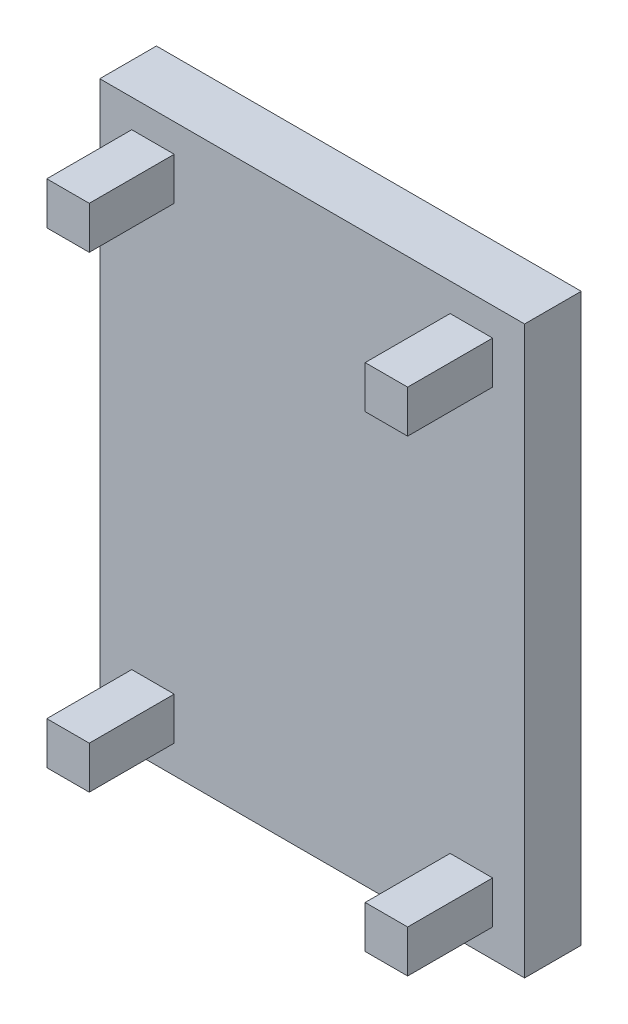
ISO-10303-21;
HEADER;
FILE_DESCRIPTION(('STEP AP214'),'2;1');
FILE_NAME('part.step','',(''),(''),'','','');
FILE_SCHEMA(('AUTOMOTIVE_DESIGN { 1 0 10303 214 1 1 1 1 }'));
ENDSEC;
DATA;
#1=APPLICATION_CONTEXT('core data for automotive mechanical design processes');
#2=APPLICATION_PROTOCOL_DEFINITION('international standard','automotive_design',2000,#1);
#3=PRODUCT_CONTEXT('',#1,'mechanical');
#4=PRODUCT('Part','Part','',(#3));
#5=PRODUCT_RELATED_PRODUCT_CATEGORY('part','',(#4));
#6=PRODUCT_DEFINITION_FORMATION('','',#4);
#7=PRODUCT_DEFINITION_CONTEXT('part definition',#1,'design');
#8=PRODUCT_DEFINITION('design','',#6,#7);
#9=PRODUCT_DEFINITION_SHAPE('','',#8);
#10=(LENGTH_UNIT() NAMED_UNIT(*) SI_UNIT(.MILLI.,.METRE.));
#11=(NAMED_UNIT(*) PLANE_ANGLE_UNIT() SI_UNIT($,.RADIAN.));
#12=(NAMED_UNIT(*) SI_UNIT($,.STERADIAN.) SOLID_ANGLE_UNIT());
#13=UNCERTAINTY_MEASURE_WITH_UNIT(LENGTH_MEASURE(1.E-05),#10,'distance_accuracy_value','');
#14=(GEOMETRIC_REPRESENTATION_CONTEXT(3) GLOBAL_UNCERTAINTY_ASSIGNED_CONTEXT((#13)) GLOBAL_UNIT_ASSIGNED_CONTEXT((#10,
#11,#12)) REPRESENTATION_CONTEXT('',''));
#15=CARTESIAN_POINT('',(0.,0.,0.));
#16=DIRECTION('',(0.,0.,1.));
#17=DIRECTION('',(1.,0.,0.));
#18=AXIS2_PLACEMENT_3D('',#15,#16,#17);
#19=CARTESIAN_POINT('',(0.,0.,200.));
#20=DIRECTION('',(0.,0.,-1.));
#21=DIRECTION('',(-1.,0.,0.));
#22=AXIS2_PLACEMENT_3D('',#19,#20,#21);
#23=PLANE('',#22);
#24=DIRECTION('',(0.,1.,0.));
#25=VECTOR('',#24,1.);
#26=CARTESIAN_POINT('',(637.101095116361,-750.42306476972,200.));
#27=LINE('',#26,#25);
#28=CARTESIAN_POINT('',(637.101095116361,-900.42306476972,200.));
#29=VERTEX_POINT('',#28);
#30=CARTESIAN_POINT('',(637.101095116361,-750.42306476972,200.));
#31=VERTEX_POINT('',#30);
#32=EDGE_CURVE('E227',#29,#31,#27,.T.);
#33=ORIENTED_EDGE('',*,*,#32,.F.);
#34=DIRECTION('',(1.,0.,0.));
#35=VECTOR('',#34,1.);
#36=CARTESIAN_POINT('',(637.101095116361,-900.42306476972,200.));
#37=LINE('',#36,#35);
#38=CARTESIAN_POINT('',(487.101095116362,-900.42306476972,200.));
#39=VERTEX_POINT('',#38);
#40=EDGE_CURVE('E217',#39,#29,#37,.T.);
#41=ORIENTED_EDGE('',*,*,#40,.F.);
#42=DIRECTION('',(0.,-1.,0.));
#43=VECTOR('',#42,1.);
#44=CARTESIAN_POINT('',(487.101095116362,-750.42306476972,200.));
#45=LINE('',#44,#43);
#46=CARTESIAN_POINT('',(487.101095116362,-750.42306476972,200.));
#47=VERTEX_POINT('',#46);
#48=EDGE_CURVE('E220',#47,#39,#45,.T.);
#49=ORIENTED_EDGE('',*,*,#48,.F.);
#50=DIRECTION('',(-1.,0.,0.));
#51=VECTOR('',#50,1.);
#52=CARTESIAN_POINT('',(637.101095116361,-750.42306476972,200.));
#53=LINE('',#52,#51);
#54=EDGE_CURVE('E224',#31,#47,#53,.T.);
#55=ORIENTED_EDGE('',*,*,#54,.F.);
#56=EDGE_LOOP('',(#33,#41,#49,#55));
#57=FACE_BOUND('',#56,.T.);
#58=DIRECTION('',(0.,1.,0.));
#59=VECTOR('',#58,1.);
#60=CARTESIAN_POINT('',(-487.101095116362,750.42306476972,200.));
#61=LINE('',#60,#59);
#62=CARTESIAN_POINT('',(-487.101095116362,750.42306476972,200.));
#63=VERTEX_POINT('',#62);
#64=CARTESIAN_POINT('',(-487.101095116362,900.42306476972,200.));
#65=VERTEX_POINT('',#64);
#66=EDGE_CURVE('E263',#63,#65,#61,.T.);
#67=ORIENTED_EDGE('',*,*,#66,.F.);
#68=DIRECTION('',(1.,0.,0.));
#69=VECTOR('',#68,1.);
#70=CARTESIAN_POINT('',(-637.101095116362,750.42306476972,200.));
#71=LINE('',#70,#69);
#72=CARTESIAN_POINT('',(-637.101095116362,750.42306476972,200.));
#73=VERTEX_POINT('',#72);
#74=EDGE_CURVE('E275',#73,#63,#71,.T.);
#75=ORIENTED_EDGE('',*,*,#74,.F.);
#76=DIRECTION('',(0.,-1.,0.));
#77=VECTOR('',#76,1.);
#78=CARTESIAN_POINT('',(-637.101095116362,750.42306476972,200.));
#79=LINE('',#78,#77);
#80=CARTESIAN_POINT('',(-637.101095116362,900.42306476972,200.));
#81=VERTEX_POINT('',#80);
#82=EDGE_CURVE('E287',#81,#73,#79,.T.);
#83=ORIENTED_EDGE('',*,*,#82,.F.);
#84=DIRECTION('',(-1.,0.,0.));
#85=VECTOR('',#84,1.);
#86=CARTESIAN_POINT('',(-637.101095116362,900.42306476972,200.));
#87=LINE('',#86,#85);
#88=EDGE_CURVE('E284',#65,#81,#87,.T.);
#89=ORIENTED_EDGE('',*,*,#88,.F.);
#90=EDGE_LOOP('',(#67,#75,#83,#89));
#91=FACE_BOUND('',#90,.T.);
#92=DIRECTION('',(0.,1.,0.));
#93=VECTOR('',#92,1.);
#94=CARTESIAN_POINT('',(750.,-1000.,200.));
#95=LINE('',#94,#93);
#96=CARTESIAN_POINT('',(750.,-1000.,200.));
#97=VERTEX_POINT('',#96);
#98=CARTESIAN_POINT('',(750.,1000.,200.));
#99=VERTEX_POINT('',#98);
#100=EDGE_CURVE('E304',#97,#99,#95,.T.);
#101=ORIENTED_EDGE('',*,*,#100,.T.);
#102=DIRECTION('',(-1.,0.,0.));
#103=VECTOR('',#102,1.);
#104=CARTESIAN_POINT('',(-750.,1000.,200.));
#105=LINE('',#104,#103);
#106=CARTESIAN_POINT('',(-750.,1000.,200.));
#107=VERTEX_POINT('',#106);
#108=EDGE_CURVE('E307',#99,#107,#105,.T.);
#109=ORIENTED_EDGE('',*,*,#108,.T.);
#110=DIRECTION('',(0.,-1.,0.));
#111=VECTOR('',#110,1.);
#112=CARTESIAN_POINT('',(-750.,-1000.,200.));
#113=LINE('',#112,#111);
#114=CARTESIAN_POINT('',(-750.,-1000.,200.));
#115=VERTEX_POINT('',#114);
#116=EDGE_CURVE('E310',#107,#115,#113,.T.);
#117=ORIENTED_EDGE('',*,*,#116,.T.);
#118=DIRECTION('',(1.,0.,0.));
#119=VECTOR('',#118,1.);
#120=CARTESIAN_POINT('',(-750.,-1000.,200.));
#121=LINE('',#120,#119);
#122=EDGE_CURVE('E312',#115,#97,#121,.T.);
#123=ORIENTED_EDGE('',*,*,#122,.T.);
#124=EDGE_LOOP('',(#101,#109,#117,#123));
#125=FACE_BOUND('',#124,.T.);
#126=DIRECTION('',(0.,1.,0.));
#127=VECTOR('',#126,1.);
#128=CARTESIAN_POINT('',(637.101095116362,750.42306476972,200.));
#129=LINE('',#128,#127);
#130=CARTESIAN_POINT('',(637.101095116362,750.42306476972,200.));
#131=VERTEX_POINT('',#130);
#132=CARTESIAN_POINT('',(637.101095116362,900.42306476972,200.));
#133=VERTEX_POINT('',#132);
#134=EDGE_CURVE('E260',#131,#133,#129,.T.);
#135=ORIENTED_EDGE('',*,*,#134,.F.);
#136=DIRECTION('',(1.,0.,0.));
#137=VECTOR('',#136,1.);
#138=CARTESIAN_POINT('',(637.101095116362,750.42306476972,200.));
#139=LINE('',#138,#137);
#140=CARTESIAN_POINT('',(487.101095116362,750.42306476972,200.));
#141=VERTEX_POINT('',#140);
#142=EDGE_CURVE('E250',#141,#131,#139,.T.);
#143=ORIENTED_EDGE('',*,*,#142,.F.);
#144=DIRECTION('',(0.,-1.,0.));
#145=VECTOR('',#144,1.);
#146=CARTESIAN_POINT('',(487.101095116362,750.42306476972,200.));
#147=LINE('',#146,#145);
#148=CARTESIAN_POINT('',(487.101095116362,900.42306476972,200.));
#149=VERTEX_POINT('',#148);
#150=EDGE_CURVE('E253',#149,#141,#147,.T.);
#151=ORIENTED_EDGE('',*,*,#150,.F.);
#152=DIRECTION('',(-1.,0.,0.));
#153=VECTOR('',#152,1.);
#154=CARTESIAN_POINT('',(637.101095116362,900.42306476972,200.));
#155=LINE('',#154,#153);
#156=EDGE_CURVE('E257',#133,#149,#155,.T.);
#157=ORIENTED_EDGE('',*,*,#156,.F.);
#158=EDGE_LOOP('',(#135,#143,#151,#157));
#159=FACE_BOUND('',#158,.T.);
#160=DIRECTION('',(0.,-1.,0.));
#161=VECTOR('',#160,1.);
#162=CARTESIAN_POINT('',(-637.101095116361,-750.42306476972,200.));
#163=LINE('',#162,#161);
#164=CARTESIAN_POINT('',(-637.101095116361,-750.42306476972,200.));
#165=VERTEX_POINT('',#164);
#166=CARTESIAN_POINT('',(-637.101095116361,-900.42306476972,200.));
#167=VERTEX_POINT('',#166);
#168=EDGE_CURVE('E170',#165,#167,#163,.T.);
#169=ORIENTED_EDGE('',*,*,#168,.F.);
#170=DIRECTION('',(-1.,0.,0.));
#171=VECTOR('',#170,1.);
#172=CARTESIAN_POINT('',(-637.101095116361,-750.42306476972,200.));
#173=LINE('',#172,#171);
#174=CARTESIAN_POINT('',(-487.101095116362,-750.42306476972,200.));
#175=VERTEX_POINT('',#174);
#176=EDGE_CURVE('E172',#175,#165,#173,.T.);
#177=ORIENTED_EDGE('',*,*,#176,.F.);
#178=DIRECTION('',(0.,1.,0.));
#179=VECTOR('',#178,1.);
#180=CARTESIAN_POINT('',(-487.101095116362,-750.42306476972,200.));
#181=LINE('',#180,#179);
#182=CARTESIAN_POINT('',(-487.101095116362,-900.42306476972,200.));
#183=VERTEX_POINT('',#182);
#184=EDGE_CURVE('E57',#183,#175,#181,.T.);
#185=ORIENTED_EDGE('',*,*,#184,.F.);
#186=DIRECTION('',(1.,0.,0.));
#187=VECTOR('',#186,1.);
#188=CARTESIAN_POINT('',(-637.101095116361,-900.42306476972,200.));
#189=LINE('',#188,#187);
#190=EDGE_CURVE('E52',#167,#183,#189,.T.);
#191=ORIENTED_EDGE('',*,*,#190,.F.);
#192=EDGE_LOOP('',(#169,#177,#185,#191));
#193=FACE_BOUND('',#192,.T.);
#194=ADVANCED_FACE('F37',(#57,#91,#125,#159,#193),#23,.F.);
#195=CARTESIAN_POINT('',(750.,-1000.,200.));
#196=DIRECTION('',(-1.,0.,0.));
#197=DIRECTION('',(0.,0.,1.));
#198=AXIS2_PLACEMENT_3D('',#195,#196,#197);
#199=PLANE('',#198);
#200=DIRECTION('',(0.,1.,0.));
#201=VECTOR('',#200,1.);
#202=CARTESIAN_POINT('',(750.,-1000.,0.));
#203=LINE('',#202,#201);
#204=CARTESIAN_POINT('',(750.,-1000.,0.));
#205=VERTEX_POINT('',#204);
#206=CARTESIAN_POINT('',(750.,1000.,0.));
#207=VERTEX_POINT('',#206);
#208=EDGE_CURVE('E303',#205,#207,#203,.T.);
#209=ORIENTED_EDGE('',*,*,#208,.T.);
#210=DIRECTION('',(0.,0.,-1.));
#211=VECTOR('',#210,1.);
#212=CARTESIAN_POINT('',(750.,1000.,200.));
#213=LINE('',#212,#211);
#214=EDGE_CURVE('E11',#99,#207,#213,.T.);
#215=ORIENTED_EDGE('',*,*,#214,.F.);
#216=ORIENTED_EDGE('',*,*,#100,.F.);
#217=DIRECTION('',(0.,0.,-1.));
#218=VECTOR('',#217,1.);
#219=CARTESIAN_POINT('',(750.,-1000.,200.));
#220=LINE('',#219,#218);
#221=EDGE_CURVE('E314',#97,#205,#220,.T.);
#222=ORIENTED_EDGE('',*,*,#221,.T.);
#223=EDGE_LOOP('',(#209,#215,#216,#222));
#224=FACE_BOUND('',#223,.T.);
#225=ADVANCED_FACE('F39',(#224),#199,.F.);
#226=CARTESIAN_POINT('',(-750.,1000.,200.));
#227=DIRECTION('',(0.,-1.,0.));
#228=DIRECTION('',(0.,0.,-1.));
#229=AXIS2_PLACEMENT_3D('',#226,#227,#228);
#230=PLANE('',#229);
#231=DIRECTION('',(-1.,0.,0.));
#232=VECTOR('',#231,1.);
#233=CARTESIAN_POINT('',(-750.,1000.,0.));
#234=LINE('',#233,#232);
#235=CARTESIAN_POINT('',(-750.,1000.,0.));
#236=VERTEX_POINT('',#235);
#237=EDGE_CURVE('E317',#207,#236,#234,.T.);
#238=ORIENTED_EDGE('',*,*,#237,.T.);
#239=DIRECTION('',(0.,0.,-1.));
#240=VECTOR('',#239,1.);
#241=CARTESIAN_POINT('',(-750.,1000.,200.));
#242=LINE('',#241,#240);
#243=EDGE_CURVE('E45',#107,#236,#242,.T.);
#244=ORIENTED_EDGE('',*,*,#243,.F.);
#245=ORIENTED_EDGE('',*,*,#108,.F.);
#246=ORIENTED_EDGE('',*,*,#214,.T.);
#247=EDGE_LOOP('',(#238,#244,#245,#246));
#248=FACE_BOUND('',#247,.T.);
#249=ADVANCED_FACE('F347',(#248),#230,.F.);
#250=CARTESIAN_POINT('',(-750.,-1000.,200.));
#251=DIRECTION('',(1.,0.,0.));
#252=DIRECTION('',(0.,0.,-1.));
#253=AXIS2_PLACEMENT_3D('',#250,#251,#252);
#254=PLANE('',#253);
#255=DIRECTION('',(0.,-1.,0.));
#256=VECTOR('',#255,1.);
#257=CARTESIAN_POINT('',(-750.,-1000.,0.));
#258=LINE('',#257,#256);
#259=CARTESIAN_POINT('',(-750.,-1000.,0.));
#260=VERTEX_POINT('',#259);
#261=EDGE_CURVE('E319',#236,#260,#258,.T.);
#262=ORIENTED_EDGE('',*,*,#261,.T.);
#263=DIRECTION('',(0.,0.,-1.));
#264=VECTOR('',#263,1.);
#265=CARTESIAN_POINT('',(-750.,-1000.,200.));
#266=LINE('',#265,#264);
#267=EDGE_CURVE('E324',#115,#260,#266,.T.);
#268=ORIENTED_EDGE('',*,*,#267,.F.);
#269=ORIENTED_EDGE('',*,*,#116,.F.);
#270=ORIENTED_EDGE('',*,*,#243,.T.);
#271=EDGE_LOOP('',(#262,#268,#269,#270));
#272=FACE_BOUND('',#271,.T.);
#273=ADVANCED_FACE('F331',(#272),#254,.F.);
#274=CARTESIAN_POINT('',(-750.,-1000.,200.));
#275=DIRECTION('',(0.,1.,0.));
#276=DIRECTION('',(0.,0.,1.));
#277=AXIS2_PLACEMENT_3D('',#274,#275,#276);
#278=PLANE('',#277);
#279=DIRECTION('',(1.,0.,0.));
#280=VECTOR('',#279,1.);
#281=CARTESIAN_POINT('',(-750.,-1000.,0.));
#282=LINE('',#281,#280);
#283=EDGE_CURVE('E308',#260,#205,#282,.T.);
#284=ORIENTED_EDGE('',*,*,#283,.T.);
#285=ORIENTED_EDGE('',*,*,#221,.F.);
#286=ORIENTED_EDGE('',*,*,#122,.F.);
#287=ORIENTED_EDGE('',*,*,#267,.T.);
#288=EDGE_LOOP('',(#284,#285,#286,#287));
#289=FACE_BOUND('',#288,.T.);
#290=ADVANCED_FACE('F340',(#289),#278,.F.);
#291=CARTESIAN_POINT('',(0.,0.,0.));
#292=DIRECTION('',(0.,0.,-1.));
#293=DIRECTION('',(-1.,0.,0.));
#294=AXIS2_PLACEMENT_3D('',#291,#292,#293);
#295=PLANE('',#294);
#296=ORIENTED_EDGE('',*,*,#208,.F.);
#297=ORIENTED_EDGE('',*,*,#283,.F.);
#298=ORIENTED_EDGE('',*,*,#261,.F.);
#299=ORIENTED_EDGE('',*,*,#237,.F.);
#300=EDGE_LOOP('',(#296,#297,#298,#299));
#301=FACE_BOUND('',#300,.T.);
#302=ADVANCED_FACE('F337',(#301),#295,.T.);
#303=CARTESIAN_POINT('',(-487.101095116362,750.42306476972,500.));
#304=DIRECTION('',(-1.,0.,0.));
#305=DIRECTION('',(0.,0.,1.));
#306=AXIS2_PLACEMENT_3D('',#303,#304,#305);
#307=PLANE('',#306);
#308=ORIENTED_EDGE('',*,*,#66,.T.);
#309=DIRECTION('',(0.,0.,-1.));
#310=VECTOR('',#309,1.);
#311=CARTESIAN_POINT('',(-487.101095116362,900.42306476972,500.));
#312=LINE('',#311,#310);
#313=CARTESIAN_POINT('',(-487.101095116362,900.42306476972,500.));
#314=VERTEX_POINT('',#313);
#315=EDGE_CURVE('E300',#314,#65,#312,.T.);
#316=ORIENTED_EDGE('',*,*,#315,.F.);
#317=DIRECTION('',(0.,1.,0.));
#318=VECTOR('',#317,1.);
#319=CARTESIAN_POINT('',(-487.101095116362,750.42306476972,500.));
#320=LINE('',#319,#318);
#321=CARTESIAN_POINT('',(-487.101095116362,750.42306476972,500.));
#322=VERTEX_POINT('',#321);
#323=EDGE_CURVE('E271',#322,#314,#320,.T.);
#324=ORIENTED_EDGE('',*,*,#323,.F.);
#325=DIRECTION('',(0.,0.,-1.));
#326=VECTOR('',#325,1.);
#327=CARTESIAN_POINT('',(-487.101095116362,750.42306476972,500.));
#328=LINE('',#327,#326);
#329=EDGE_CURVE('E281',#322,#63,#328,.T.);
#330=ORIENTED_EDGE('',*,*,#329,.T.);
#331=EDGE_LOOP('',(#308,#316,#324,#330));
#332=FACE_BOUND('',#331,.T.);
#333=ADVANCED_FACE('F362',(#332),#307,.F.);
#334=CARTESIAN_POINT('',(-637.101095116362,900.42306476972,500.));
#335=DIRECTION('',(0.,-1.,0.));
#336=DIRECTION('',(0.,0.,-1.));
#337=AXIS2_PLACEMENT_3D('',#334,#335,#336);
#338=PLANE('',#337);
#339=ORIENTED_EDGE('',*,*,#88,.T.);
#340=DIRECTION('',(0.,0.,-1.));
#341=VECTOR('',#340,1.);
#342=CARTESIAN_POINT('',(-637.101095116362,900.42306476972,500.));
#343=LINE('',#342,#341);
#344=CARTESIAN_POINT('',(-637.101095116362,900.42306476972,500.));
#345=VERTEX_POINT('',#344);
#346=EDGE_CURVE('E297',#345,#81,#343,.T.);
#347=ORIENTED_EDGE('',*,*,#346,.F.);
#348=DIRECTION('',(-1.,0.,0.));
#349=VECTOR('',#348,1.);
#350=CARTESIAN_POINT('',(-637.101095116362,900.42306476972,500.));
#351=LINE('',#350,#349);
#352=EDGE_CURVE('E274',#314,#345,#351,.T.);
#353=ORIENTED_EDGE('',*,*,#352,.F.);
#354=ORIENTED_EDGE('',*,*,#315,.T.);
#355=EDGE_LOOP('',(#339,#347,#353,#354));
#356=FACE_BOUND('',#355,.T.);
#357=ADVANCED_FACE('F381',(#356),#338,.F.);
#358=CARTESIAN_POINT('',(-637.101095116362,750.42306476972,500.));
#359=DIRECTION('',(1.,0.,0.));
#360=DIRECTION('',(0.,0.,-1.));
#361=AXIS2_PLACEMENT_3D('',#358,#359,#360);
#362=PLANE('',#361);
#363=ORIENTED_EDGE('',*,*,#82,.T.);
#364=DIRECTION('',(0.,0.,-1.));
#365=VECTOR('',#364,1.);
#366=CARTESIAN_POINT('',(-637.101095116362,750.42306476972,500.));
#367=LINE('',#366,#365);
#368=CARTESIAN_POINT('',(-637.101095116362,750.42306476972,500.));
#369=VERTEX_POINT('',#368);
#370=EDGE_CURVE('E294',#369,#73,#367,.T.);
#371=ORIENTED_EDGE('',*,*,#370,.F.);
#372=DIRECTION('',(0.,-1.,0.));
#373=VECTOR('',#372,1.);
#374=CARTESIAN_POINT('',(-637.101095116362,750.42306476972,500.));
#375=LINE('',#374,#373);
#376=EDGE_CURVE('E277',#345,#369,#375,.T.);
#377=ORIENTED_EDGE('',*,*,#376,.F.);
#378=ORIENTED_EDGE('',*,*,#346,.T.);
#379=EDGE_LOOP('',(#363,#371,#377,#378));
#380=FACE_BOUND('',#379,.T.);
#381=ADVANCED_FACE('F388',(#380),#362,.F.);
#382=CARTESIAN_POINT('',(-637.101095116362,750.42306476972,500.));
#383=DIRECTION('',(0.,1.,0.));
#384=DIRECTION('',(0.,0.,1.));
#385=AXIS2_PLACEMENT_3D('',#382,#383,#384);
#386=PLANE('',#385);
#387=ORIENTED_EDGE('',*,*,#74,.T.);
#388=ORIENTED_EDGE('',*,*,#329,.F.);
#389=DIRECTION('',(1.,0.,0.));
#390=VECTOR('',#389,1.);
#391=CARTESIAN_POINT('',(-637.101095116362,750.42306476972,500.));
#392=LINE('',#391,#390);
#393=EDGE_CURVE('E279',#369,#322,#392,.T.);
#394=ORIENTED_EDGE('',*,*,#393,.F.);
#395=ORIENTED_EDGE('',*,*,#370,.T.);
#396=EDGE_LOOP('',(#387,#388,#394,#395));
#397=FACE_BOUND('',#396,.T.);
#398=ADVANCED_FACE('F395',(#397),#386,.F.);
#399=CARTESIAN_POINT('',(0.,0.,500.));
#400=DIRECTION('',(0.,0.,-1.));
#401=DIRECTION('',(-1.,0.,0.));
#402=AXIS2_PLACEMENT_3D('',#399,#400,#401);
#403=PLANE('',#402);
#404=ORIENTED_EDGE('',*,*,#323,.T.);
#405=ORIENTED_EDGE('',*,*,#352,.T.);
#406=ORIENTED_EDGE('',*,*,#376,.T.);
#407=ORIENTED_EDGE('',*,*,#393,.T.);
#408=EDGE_LOOP('',(#404,#405,#406,#407));
#409=FACE_BOUND('',#408,.T.);
#410=ADVANCED_FACE('F403',(#409),#403,.F.);
#411=CARTESIAN_POINT('',(637.101095116362,750.42306476972,500.));
#412=DIRECTION('',(-1.,0.,0.));
#413=DIRECTION('',(0.,0.,1.));
#414=AXIS2_PLACEMENT_3D('',#411,#412,#413);
#415=PLANE('',#414);
#416=ORIENTED_EDGE('',*,*,#134,.T.);
#417=DIRECTION('',(0.,0.,-1.));
#418=VECTOR('',#417,1.);
#419=CARTESIAN_POINT('',(637.101095116362,900.42306476972,500.));
#420=LINE('',#419,#418);
#421=CARTESIAN_POINT('',(637.101095116362,900.42306476972,500.));
#422=VERTEX_POINT('',#421);
#423=EDGE_CURVE('E230',#422,#133,#420,.T.);
#424=ORIENTED_EDGE('',*,*,#423,.F.);
#425=DIRECTION('',(0.,1.,0.));
#426=VECTOR('',#425,1.);
#427=CARTESIAN_POINT('',(637.101095116362,750.42306476972,500.));
#428=LINE('',#427,#426);
#429=CARTESIAN_POINT('',(637.101095116362,750.42306476972,500.));
#430=VERTEX_POINT('',#429);
#431=EDGE_CURVE('E254',#430,#422,#428,.T.);
#432=ORIENTED_EDGE('',*,*,#431,.F.);
#433=DIRECTION('',(0.,0.,-1.));
#434=VECTOR('',#433,1.);
#435=CARTESIAN_POINT('',(637.101095116362,750.42306476972,500.));
#436=LINE('',#435,#434);
#437=EDGE_CURVE('E246',#430,#131,#436,.T.);
#438=ORIENTED_EDGE('',*,*,#437,.T.);
#439=EDGE_LOOP('',(#416,#424,#432,#438));
#440=FACE_BOUND('',#439,.T.);
#441=ADVANCED_FACE('F411',(#440),#415,.F.);
#442=CARTESIAN_POINT('',(637.101095116362,900.42306476972,500.));
#443=DIRECTION('',(0.,-1.,0.));
#444=DIRECTION('',(0.,0.,-1.));
#445=AXIS2_PLACEMENT_3D('',#442,#443,#444);
#446=PLANE('',#445);
#447=ORIENTED_EDGE('',*,*,#156,.T.);
#448=DIRECTION('',(0.,0.,-1.));
#449=VECTOR('',#448,1.);
#450=CARTESIAN_POINT('',(487.101095116362,900.42306476972,500.));
#451=LINE('',#450,#449);
#452=CARTESIAN_POINT('',(487.101095116362,900.42306476972,500.));
#453=VERTEX_POINT('',#452);
#454=EDGE_CURVE('E240',#453,#149,#451,.T.);
#455=ORIENTED_EDGE('',*,*,#454,.F.);
#456=DIRECTION('',(-1.,0.,0.));
#457=VECTOR('',#456,1.);
#458=CARTESIAN_POINT('',(637.101095116362,900.42306476972,500.));
#459=LINE('',#458,#457);
#460=EDGE_CURVE('E267',#422,#453,#459,.T.);
#461=ORIENTED_EDGE('',*,*,#460,.F.);
#462=ORIENTED_EDGE('',*,*,#423,.T.);
#463=EDGE_LOOP('',(#447,#455,#461,#462));
#464=FACE_BOUND('',#463,.T.);
#465=ADVANCED_FACE('F419',(#464),#446,.F.);
#466=CARTESIAN_POINT('',(487.101095116362,750.42306476972,500.));
#467=DIRECTION('',(1.,0.,0.));
#468=DIRECTION('',(0.,0.,-1.));
#469=AXIS2_PLACEMENT_3D('',#466,#467,#468);
#470=PLANE('',#469);
#471=ORIENTED_EDGE('',*,*,#150,.T.);
#472=DIRECTION('',(0.,0.,-1.));
#473=VECTOR('',#472,1.);
#474=CARTESIAN_POINT('',(487.101095116362,750.42306476972,500.));
#475=LINE('',#474,#473);
#476=CARTESIAN_POINT('',(487.101095116362,750.42306476972,500.));
#477=VERTEX_POINT('',#476);
#478=EDGE_CURVE('E243',#477,#141,#475,.T.);
#479=ORIENTED_EDGE('',*,*,#478,.F.);
#480=DIRECTION('',(0.,-1.,0.));
#481=VECTOR('',#480,1.);
#482=CARTESIAN_POINT('',(487.101095116362,750.42306476972,500.));
#483=LINE('',#482,#481);
#484=EDGE_CURVE('E265',#453,#477,#483,.T.);
#485=ORIENTED_EDGE('',*,*,#484,.F.);
#486=ORIENTED_EDGE('',*,*,#454,.T.);
#487=EDGE_LOOP('',(#471,#479,#485,#486));
#488=FACE_BOUND('',#487,.T.);
#489=ADVANCED_FACE('F427',(#488),#470,.F.);
#490=CARTESIAN_POINT('',(637.101095116362,750.42306476972,500.));
#491=DIRECTION('',(0.,1.,0.));
#492=DIRECTION('',(0.,0.,1.));
#493=AXIS2_PLACEMENT_3D('',#490,#491,#492);
#494=PLANE('',#493);
#495=ORIENTED_EDGE('',*,*,#142,.T.);
#496=ORIENTED_EDGE('',*,*,#437,.F.);
#497=DIRECTION('',(1.,0.,0.));
#498=VECTOR('',#497,1.);
#499=CARTESIAN_POINT('',(637.101095116362,750.42306476972,500.));
#500=LINE('',#499,#498);
#501=EDGE_CURVE('E249',#477,#430,#500,.T.);
#502=ORIENTED_EDGE('',*,*,#501,.F.);
#503=ORIENTED_EDGE('',*,*,#478,.T.);
#504=EDGE_LOOP('',(#495,#496,#502,#503));
#505=FACE_BOUND('',#504,.T.);
#506=ADVANCED_FACE('F435',(#505),#494,.F.);
#507=CARTESIAN_POINT('',(0.,0.,500.));
#508=DIRECTION('',(0.,0.,1.));
#509=DIRECTION('',(1.,0.,0.));
#510=AXIS2_PLACEMENT_3D('',#507,#508,#509);
#511=PLANE('',#510);
#512=ORIENTED_EDGE('',*,*,#431,.T.);
#513=ORIENTED_EDGE('',*,*,#460,.T.);
#514=ORIENTED_EDGE('',*,*,#484,.T.);
#515=ORIENTED_EDGE('',*,*,#501,.T.);
#516=EDGE_LOOP('',(#512,#513,#514,#515));
#517=FACE_BOUND('',#516,.T.);
#518=ADVANCED_FACE('F443',(#517),#511,.T.);
#519=CARTESIAN_POINT('',(637.101095116361,-750.42306476972,500.));
#520=DIRECTION('',(-1.,0.,0.));
#521=DIRECTION('',(0.,0.,1.));
#522=AXIS2_PLACEMENT_3D('',#519,#520,#521);
#523=PLANE('',#522);
#524=ORIENTED_EDGE('',*,*,#32,.T.);
#525=DIRECTION('',(0.,0.,-1.));
#526=VECTOR('',#525,1.);
#527=CARTESIAN_POINT('',(637.101095116361,-750.42306476972,500.));
#528=LINE('',#527,#526);
#529=CARTESIAN_POINT('',(637.101095116361,-750.42306476972,500.));
#530=VERTEX_POINT('',#529);
#531=EDGE_CURVE('E176',#530,#31,#528,.T.);
#532=ORIENTED_EDGE('',*,*,#531,.F.);
#533=DIRECTION('',(0.,1.,0.));
#534=VECTOR('',#533,1.);
#535=CARTESIAN_POINT('',(637.101095116361,-750.42306476972,500.));
#536=LINE('',#535,#534);
#537=CARTESIAN_POINT('',(637.101095116361,-900.42306476972,500.));
#538=VERTEX_POINT('',#537);
#539=EDGE_CURVE('E221',#538,#530,#536,.T.);
#540=ORIENTED_EDGE('',*,*,#539,.F.);
#541=DIRECTION('',(0.,0.,-1.));
#542=VECTOR('',#541,1.);
#543=CARTESIAN_POINT('',(637.101095116361,-900.42306476972,500.));
#544=LINE('',#543,#542);
#545=EDGE_CURVE('E213',#538,#29,#544,.T.);
#546=ORIENTED_EDGE('',*,*,#545,.T.);
#547=EDGE_LOOP('',(#524,#532,#540,#546));
#548=FACE_BOUND('',#547,.T.);
#549=ADVANCED_FACE('F451',(#548),#523,.F.);
#550=CARTESIAN_POINT('',(637.101095116361,-750.42306476972,500.));
#551=DIRECTION('',(0.,-1.,0.));
#552=DIRECTION('',(0.,0.,-1.));
#553=AXIS2_PLACEMENT_3D('',#550,#551,#552);
#554=PLANE('',#553);
#555=ORIENTED_EDGE('',*,*,#54,.T.);
#556=DIRECTION('',(0.,0.,-1.));
#557=VECTOR('',#556,1.);
#558=CARTESIAN_POINT('',(487.101095116362,-750.42306476972,500.));
#559=LINE('',#558,#557);
#560=CARTESIAN_POINT('',(487.101095116362,-750.42306476972,500.));
#561=VERTEX_POINT('',#560);
#562=EDGE_CURVE('E207',#561,#47,#559,.T.);
#563=ORIENTED_EDGE('',*,*,#562,.F.);
#564=DIRECTION('',(-1.,0.,0.));
#565=VECTOR('',#564,1.);
#566=CARTESIAN_POINT('',(637.101095116361,-750.42306476972,500.));
#567=LINE('',#566,#565);
#568=EDGE_CURVE('E234',#530,#561,#567,.T.);
#569=ORIENTED_EDGE('',*,*,#568,.F.);
#570=ORIENTED_EDGE('',*,*,#531,.T.);
#571=EDGE_LOOP('',(#555,#563,#569,#570));
#572=FACE_BOUND('',#571,.T.);
#573=ADVANCED_FACE('F459',(#572),#554,.F.);
#574=CARTESIAN_POINT('',(487.101095116362,-750.42306476972,500.));
#575=DIRECTION('',(1.,0.,0.));
#576=DIRECTION('',(0.,0.,-1.));
#577=AXIS2_PLACEMENT_3D('',#574,#575,#576);
#578=PLANE('',#577);
#579=ORIENTED_EDGE('',*,*,#48,.T.);
#580=DIRECTION('',(0.,0.,-1.));
#581=VECTOR('',#580,1.);
#582=CARTESIAN_POINT('',(487.101095116362,-900.42306476972,500.));
#583=LINE('',#582,#581);
#584=CARTESIAN_POINT('',(487.101095116362,-900.42306476972,500.));
#585=VERTEX_POINT('',#584);
#586=EDGE_CURVE('E210',#585,#39,#583,.T.);
#587=ORIENTED_EDGE('',*,*,#586,.F.);
#588=DIRECTION('',(0.,-1.,0.));
#589=VECTOR('',#588,1.);
#590=CARTESIAN_POINT('',(487.101095116362,-750.42306476972,500.));
#591=LINE('',#590,#589);
#592=EDGE_CURVE('E232',#561,#585,#591,.T.);
#593=ORIENTED_EDGE('',*,*,#592,.F.);
#594=ORIENTED_EDGE('',*,*,#562,.T.);
#595=EDGE_LOOP('',(#579,#587,#593,#594));
#596=FACE_BOUND('',#595,.T.);
#597=ADVANCED_FACE('F467',(#596),#578,.F.);
#598=CARTESIAN_POINT('',(637.101095116361,-900.42306476972,500.));
#599=DIRECTION('',(0.,1.,0.));
#600=DIRECTION('',(0.,0.,1.));
#601=AXIS2_PLACEMENT_3D('',#598,#599,#600);
#602=PLANE('',#601);
#603=ORIENTED_EDGE('',*,*,#40,.T.);
#604=ORIENTED_EDGE('',*,*,#545,.F.);
#605=DIRECTION('',(1.,0.,0.));
#606=VECTOR('',#605,1.);
#607=CARTESIAN_POINT('',(637.101095116361,-900.42306476972,500.));
#608=LINE('',#607,#606);
#609=EDGE_CURVE('E216',#585,#538,#608,.T.);
#610=ORIENTED_EDGE('',*,*,#609,.F.);
#611=ORIENTED_EDGE('',*,*,#586,.T.);
#612=EDGE_LOOP('',(#603,#604,#610,#611));
#613=FACE_BOUND('',#612,.T.);
#614=ADVANCED_FACE('F475',(#613),#602,.F.);
#615=CARTESIAN_POINT('',(0.,0.,500.));
#616=DIRECTION('',(0.,0.,-1.));
#617=DIRECTION('',(-1.,0.,0.));
#618=AXIS2_PLACEMENT_3D('',#615,#616,#617);
#619=PLANE('',#618);
#620=ORIENTED_EDGE('',*,*,#539,.T.);
#621=ORIENTED_EDGE('',*,*,#568,.T.);
#622=ORIENTED_EDGE('',*,*,#592,.T.);
#623=ORIENTED_EDGE('',*,*,#609,.T.);
#624=EDGE_LOOP('',(#620,#621,#622,#623));
#625=FACE_BOUND('',#624,.T.);
#626=ADVANCED_FACE('F483',(#625),#619,.F.);
#627=CARTESIAN_POINT('',(-637.101095116361,-750.42306476972,500.));
#628=DIRECTION('',(1.,0.,0.));
#629=DIRECTION('',(0.,0.,-1.));
#630=AXIS2_PLACEMENT_3D('',#627,#628,#629);
#631=PLANE('',#630);
#632=ORIENTED_EDGE('',*,*,#168,.T.);
#633=DIRECTION('',(0.,0.,-1.));
#634=VECTOR('',#633,1.);
#635=CARTESIAN_POINT('',(-637.101095116361,-900.42306476972,500.));
#636=LINE('',#635,#634);
#637=CARTESIAN_POINT('',(-637.101095116361,-900.42306476972,500.));
#638=VERTEX_POINT('',#637);
#639=EDGE_CURVE('E645',#638,#167,#636,.T.);
#640=ORIENTED_EDGE('',*,*,#639,.F.);
#641=DIRECTION('',(0.,-1.,0.));
#642=VECTOR('',#641,1.);
#643=CARTESIAN_POINT('',(-637.101095116361,-750.42306476972,500.));
#644=LINE('',#643,#642);
#645=CARTESIAN_POINT('',(-637.101095116361,-750.42306476972,500.));
#646=VERTEX_POINT('',#645);
#647=EDGE_CURVE('E187',#646,#638,#644,.T.);
#648=ORIENTED_EDGE('',*,*,#647,.F.);
#649=DIRECTION('',(0.,0.,-1.));
#650=VECTOR('',#649,1.);
#651=CARTESIAN_POINT('',(-637.101095116361,-750.42306476972,500.));
#652=LINE('',#651,#650);
#653=EDGE_CURVE('E183',#646,#165,#652,.T.);
#654=ORIENTED_EDGE('',*,*,#653,.T.);
#655=EDGE_LOOP('',(#632,#640,#648,#654));
#656=FACE_BOUND('',#655,.T.);
#657=ADVANCED_FACE('F189',(#656),#631,.F.);
#658=CARTESIAN_POINT('',(-637.101095116361,-900.42306476972,500.));
#659=DIRECTION('',(0.,1.,0.));
#660=DIRECTION('',(0.,0.,1.));
#661=AXIS2_PLACEMENT_3D('',#658,#659,#660);
#662=PLANE('',#661);
#663=ORIENTED_EDGE('',*,*,#190,.T.);
#664=DIRECTION('',(0.,0.,-1.));
#665=VECTOR('',#664,1.);
#666=CARTESIAN_POINT('',(-487.101095116362,-900.42306476972,500.));
#667=LINE('',#666,#665);
#668=CARTESIAN_POINT('',(-487.101095116362,-900.42306476972,500.));
#669=VERTEX_POINT('',#668);
#670=EDGE_CURVE('E195',#669,#183,#667,.T.);
#671=ORIENTED_EDGE('',*,*,#670,.F.);
#672=DIRECTION('',(1.,0.,0.));
#673=VECTOR('',#672,1.);
#674=CARTESIAN_POINT('',(-637.101095116361,-900.42306476972,500.));
#675=LINE('',#674,#673);
#676=EDGE_CURVE('E202',#638,#669,#675,.T.);
#677=ORIENTED_EDGE('',*,*,#676,.F.);
#678=ORIENTED_EDGE('',*,*,#639,.T.);
#679=EDGE_LOOP('',(#663,#671,#677,#678));
#680=FACE_BOUND('',#679,.T.);
#681=ADVANCED_FACE('F498',(#680),#662,.F.);
#682=CARTESIAN_POINT('',(-487.101095116362,-750.42306476972,500.));
#683=DIRECTION('',(-1.,0.,0.));
#684=DIRECTION('',(0.,0.,1.));
#685=AXIS2_PLACEMENT_3D('',#682,#683,#684);
#686=PLANE('',#685);
#687=ORIENTED_EDGE('',*,*,#184,.T.);
#688=DIRECTION('',(0.,0.,-1.));
#689=VECTOR('',#688,1.);
#690=CARTESIAN_POINT('',(-487.101095116362,-750.42306476972,500.));
#691=LINE('',#690,#689);
#692=CARTESIAN_POINT('',(-487.101095116362,-750.42306476972,500.));
#693=VERTEX_POINT('',#692);
#694=EDGE_CURVE('E186',#693,#175,#691,.T.);
#695=ORIENTED_EDGE('',*,*,#694,.F.);
#696=DIRECTION('',(0.,1.,0.));
#697=VECTOR('',#696,1.);
#698=CARTESIAN_POINT('',(-487.101095116362,-750.42306476972,500.));
#699=LINE('',#698,#697);
#700=EDGE_CURVE('E193',#669,#693,#699,.T.);
#701=ORIENTED_EDGE('',*,*,#700,.F.);
#702=ORIENTED_EDGE('',*,*,#670,.T.);
#703=EDGE_LOOP('',(#687,#695,#701,#702));
#704=FACE_BOUND('',#703,.T.);
#705=ADVANCED_FACE('F505',(#704),#686,.F.);
#706=CARTESIAN_POINT('',(-637.101095116361,-750.42306476972,500.));
#707=DIRECTION('',(0.,-1.,0.));
#708=DIRECTION('',(0.,0.,-1.));
#709=AXIS2_PLACEMENT_3D('',#706,#707,#708);
#710=PLANE('',#709);
#711=ORIENTED_EDGE('',*,*,#176,.T.);
#712=ORIENTED_EDGE('',*,*,#653,.F.);
#713=DIRECTION('',(-1.,0.,0.));
#714=VECTOR('',#713,1.);
#715=CARTESIAN_POINT('',(-637.101095116361,-750.42306476972,500.));
#716=LINE('',#715,#714);
#717=EDGE_CURVE('E191',#693,#646,#716,.T.);
#718=ORIENTED_EDGE('',*,*,#717,.F.);
#719=ORIENTED_EDGE('',*,*,#694,.T.);
#720=EDGE_LOOP('',(#711,#712,#718,#719));
#721=FACE_BOUND('',#720,.T.);
#722=ADVANCED_FACE('F181',(#721),#710,.F.);
#723=CARTESIAN_POINT('',(0.,0.,500.));
#724=DIRECTION('',(0.,0.,1.));
#725=DIRECTION('',(1.,0.,0.));
#726=AXIS2_PLACEMENT_3D('',#723,#724,#725);
#727=PLANE('',#726);
#728=ORIENTED_EDGE('',*,*,#647,.T.);
#729=ORIENTED_EDGE('',*,*,#676,.T.);
#730=ORIENTED_EDGE('',*,*,#700,.T.);
#731=ORIENTED_EDGE('',*,*,#717,.T.);
#732=EDGE_LOOP('',(#728,#729,#730,#731));
#733=FACE_BOUND('',#732,.T.);
#734=ADVANCED_FACE('F520',(#733),#727,.T.);
#735=CLOSED_SHELL('',(#194,#225,#249,#273,#290,#302,#333,#357,#381,#398,#410,#441,#465,#489,
#506,#518,#549,#573,#597,#614,#626,#657,#681,#705,#722,#734));
#736=MANIFOLD_SOLID_BREP('B2',#735);
#737=ADVANCED_BREP_SHAPE_REPRESENTATION('',(#18,#736),#14);
#738=SHAPE_DEFINITION_REPRESENTATION(#9,#737);
ENDSEC;
END-ISO-10303-21;
